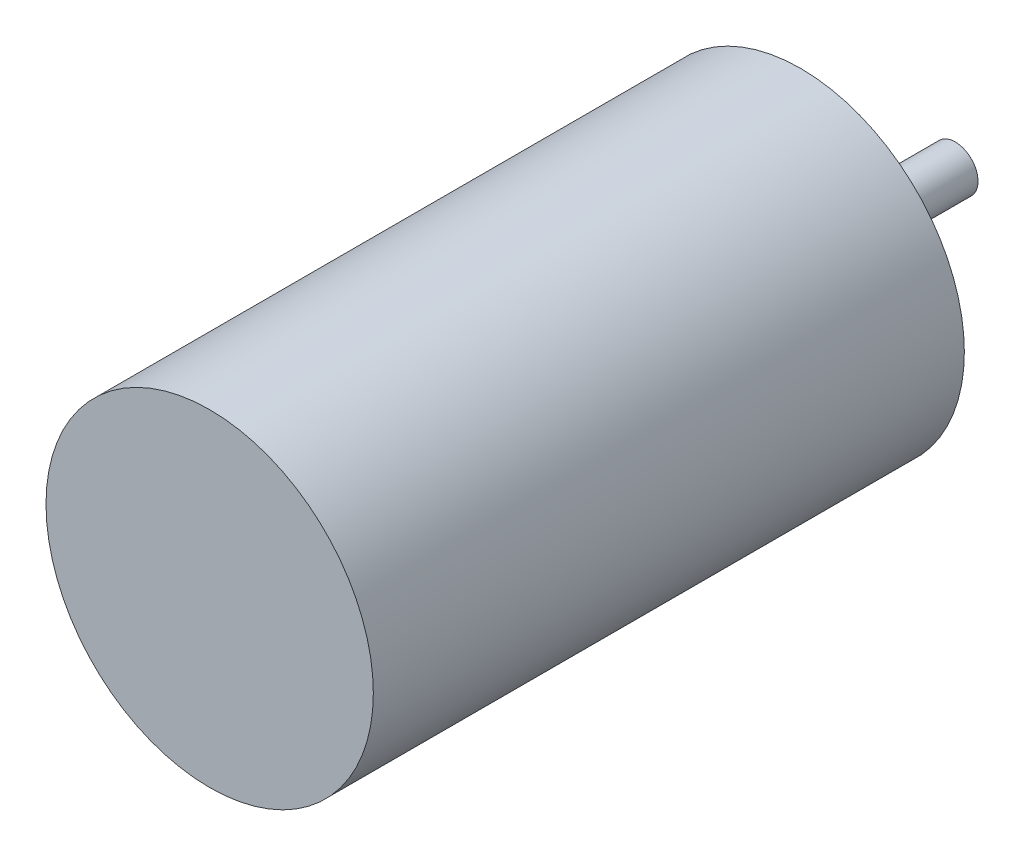
ISO-10303-21;
HEADER;
FILE_DESCRIPTION(('STEP AP214'),'2;1');
FILE_NAME('part.step','',(''),(''),'','','');
FILE_SCHEMA(('AUTOMOTIVE_DESIGN { 1 0 10303 214 1 1 1 1 }'));
ENDSEC;
DATA;
#1=APPLICATION_CONTEXT('core data for automotive mechanical design processes');
#2=APPLICATION_PROTOCOL_DEFINITION('international standard','automotive_design',2000,#1);
#3=PRODUCT_CONTEXT('',#1,'mechanical');
#4=PRODUCT('Part','Part','',(#3));
#5=PRODUCT_RELATED_PRODUCT_CATEGORY('part','',(#4));
#6=PRODUCT_DEFINITION_FORMATION('','',#4);
#7=PRODUCT_DEFINITION_CONTEXT('part definition',#1,'design');
#8=PRODUCT_DEFINITION('design','',#6,#7);
#9=PRODUCT_DEFINITION_SHAPE('','',#8);
#10=(LENGTH_UNIT() NAMED_UNIT(*) SI_UNIT(.MILLI.,.METRE.));
#11=(NAMED_UNIT(*) PLANE_ANGLE_UNIT() SI_UNIT($,.RADIAN.));
#12=(NAMED_UNIT(*) SI_UNIT($,.STERADIAN.) SOLID_ANGLE_UNIT());
#13=UNCERTAINTY_MEASURE_WITH_UNIT(LENGTH_MEASURE(1.E-05),#10,'distance_accuracy_value','');
#14=(GEOMETRIC_REPRESENTATION_CONTEXT(3) GLOBAL_UNCERTAINTY_ASSIGNED_CONTEXT((#13)) GLOBAL_UNIT_ASSIGNED_CONTEXT((#10,
#11,#12)) REPRESENTATION_CONTEXT('',''));
#15=CARTESIAN_POINT('',(0.,0.,0.));
#16=DIRECTION('',(0.,0.,1.));
#17=DIRECTION('',(1.,0.,0.));
#18=AXIS2_PLACEMENT_3D('',#15,#16,#17);
#19=CARTESIAN_POINT('',(0.,0.,65.));
#20=DIRECTION('',(0.,0.,-1.));
#21=DIRECTION('',(-1.,0.,0.));
#22=AXIS2_PLACEMENT_3D('',#19,#20,#21);
#23=CYLINDRICAL_SURFACE('',#22,18.);
#24=CARTESIAN_POINT('',(0.,0.,65.));
#25=DIRECTION('',(0.,0.,1.));
#26=DIRECTION('',(1.,0.,0.));
#27=AXIS2_PLACEMENT_3D('',#24,#25,#26);
#28=CIRCLE('',#27,18.);
#29=CARTESIAN_POINT('',(18.,0.,65.));
#30=VERTEX_POINT('',#29);
#31=EDGE_CURVE('E41',#30,#30,#28,.T.);
#32=ORIENTED_EDGE('',*,*,#31,.F.);
#33=EDGE_LOOP('',(#32));
#34=FACE_BOUND('',#33,.T.);
#35=CARTESIAN_POINT('',(0.,0.,0.));
#36=DIRECTION('',(0.,0.,1.));
#37=DIRECTION('',(1.,0.,0.));
#38=AXIS2_PLACEMENT_3D('',#35,#36,#37);
#39=CIRCLE('',#38,18.);
#40=CARTESIAN_POINT('',(18.,0.,0.));
#41=VERTEX_POINT('',#40);
#42=EDGE_CURVE('E45',#41,#41,#39,.T.);
#43=ORIENTED_EDGE('',*,*,#42,.T.);
#44=EDGE_LOOP('',(#43));
#45=FACE_BOUND('',#44,.T.);
#46=ADVANCED_FACE('F35',(#34,#45),#23,.T.);
#47=CARTESIAN_POINT('',(0.,0.,65.));
#48=DIRECTION('',(0.,0.,1.));
#49=DIRECTION('',(1.,0.,0.));
#50=AXIS2_PLACEMENT_3D('',#47,#48,#49);
#51=PLANE('',#50);
#52=ORIENTED_EDGE('',*,*,#31,.T.);
#53=EDGE_LOOP('',(#52));
#54=FACE_BOUND('',#53,.T.);
#55=ADVANCED_FACE('F66',(#54),#51,.T.);
#56=CARTESIAN_POINT('',(0.,0.,0.));
#57=DIRECTION('',(0.,0.,1.));
#58=DIRECTION('',(1.,0.,0.));
#59=AXIS2_PLACEMENT_3D('',#56,#57,#58);
#60=PLANE('',#59);
#61=CARTESIAN_POINT('',(0.,0.,0.));
#62=DIRECTION('',(0.,0.,1.));
#63=DIRECTION('',(1.,0.,0.));
#64=AXIS2_PLACEMENT_3D('',#61,#62,#63);
#65=CIRCLE('',#64,2.5);
#66=CARTESIAN_POINT('',(2.5,0.,0.));
#67=VERTEX_POINT('',#66);
#68=EDGE_CURVE('E10',#67,#67,#65,.F.);
#69=ORIENTED_EDGE('',*,*,#68,.F.);
#70=EDGE_LOOP('',(#69));
#71=FACE_BOUND('',#70,.T.);
#72=ORIENTED_EDGE('',*,*,#42,.F.);
#73=EDGE_LOOP('',(#72));
#74=FACE_BOUND('',#73,.T.);
#75=ADVANCED_FACE('F59',(#71,#74),#60,.F.);
#76=CARTESIAN_POINT('',(0.,0.,-17.));
#77=DIRECTION('',(0.,0.,1.));
#78=DIRECTION('',(1.,0.,0.));
#79=AXIS2_PLACEMENT_3D('',#76,#77,#78);
#80=CYLINDRICAL_SURFACE('',#79,2.5);
#81=CARTESIAN_POINT('',(0.,0.,-17.));
#82=DIRECTION('',(0.,0.,-1.));
#83=DIRECTION('',(-1.,0.,0.));
#84=AXIS2_PLACEMENT_3D('',#81,#82,#83);
#85=CIRCLE('',#84,2.5);
#86=CARTESIAN_POINT('',(-2.5,0.,-17.));
#87=VERTEX_POINT('',#86);
#88=EDGE_CURVE('E50',#87,#87,#85,.T.);
#89=ORIENTED_EDGE('',*,*,#88,.F.);
#90=EDGE_LOOP('',(#89));
#91=FACE_BOUND('',#90,.T.);
#92=ORIENTED_EDGE('',*,*,#68,.T.);
#93=EDGE_LOOP('',(#92));
#94=FACE_BOUND('',#93,.T.);
#95=ADVANCED_FACE('F57',(#91,#94),#80,.T.);
#96=CARTESIAN_POINT('',(0.,0.,-17.));
#97=DIRECTION('',(0.,0.,-1.));
#98=DIRECTION('',(-1.,0.,0.));
#99=AXIS2_PLACEMENT_3D('',#96,#97,#98);
#100=PLANE('',#99);
#101=ORIENTED_EDGE('',*,*,#88,.T.);
#102=EDGE_LOOP('',(#101));
#103=FACE_BOUND('',#102,.T.);
#104=ADVANCED_FACE('F55',(#103),#100,.T.);
#105=CLOSED_SHELL('',(#46,#55,#75,#95,#104));
#106=MANIFOLD_SOLID_BREP('B2',#105);
#107=ADVANCED_BREP_SHAPE_REPRESENTATION('',(#18,#106),#14);
#108=SHAPE_DEFINITION_REPRESENTATION(#9,#107);
ENDSEC;
END-ISO-10303-21;
